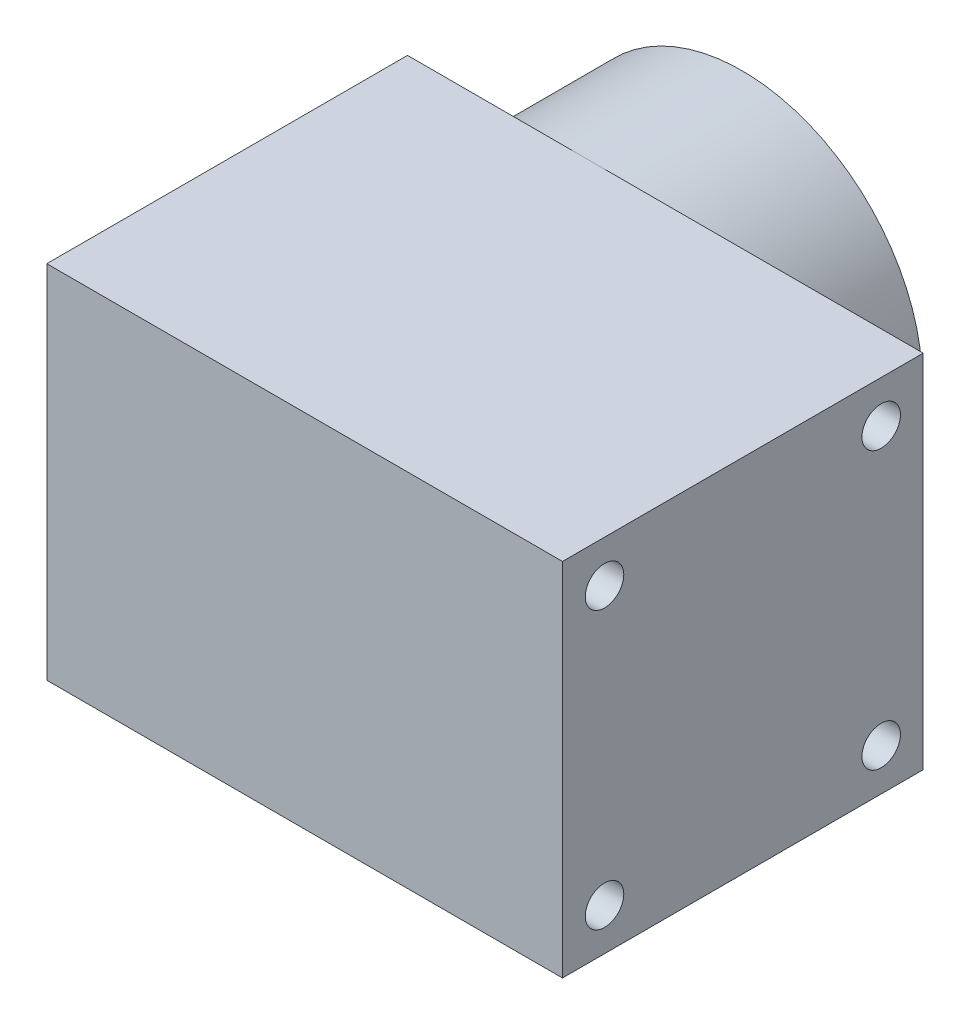
ISO-10303-21;
HEADER;
FILE_DESCRIPTION(('STEP AP214'),'2;1');
FILE_NAME('part.step','',(''),(''),'','','');
FILE_SCHEMA(('AUTOMOTIVE_DESIGN { 1 0 10303 214 1 1 1 1 }'));
ENDSEC;
DATA;
#1=APPLICATION_CONTEXT('core data for automotive mechanical design processes');
#2=APPLICATION_PROTOCOL_DEFINITION('international standard','automotive_design',2000,#1);
#3=PRODUCT_CONTEXT('',#1,'mechanical');
#4=PRODUCT('Part','Part','',(#3));
#5=PRODUCT_RELATED_PRODUCT_CATEGORY('part','',(#4));
#6=PRODUCT_DEFINITION_FORMATION('','',#4);
#7=PRODUCT_DEFINITION_CONTEXT('part definition',#1,'design');
#8=PRODUCT_DEFINITION('design','',#6,#7);
#9=PRODUCT_DEFINITION_SHAPE('','',#8);
#10=(LENGTH_UNIT() NAMED_UNIT(*) SI_UNIT(.MILLI.,.METRE.));
#11=(NAMED_UNIT(*) PLANE_ANGLE_UNIT() SI_UNIT($,.RADIAN.));
#12=(NAMED_UNIT(*) SI_UNIT($,.STERADIAN.) SOLID_ANGLE_UNIT());
#13=UNCERTAINTY_MEASURE_WITH_UNIT(LENGTH_MEASURE(1.E-05),#10,'distance_accuracy_value','');
#14=(GEOMETRIC_REPRESENTATION_CONTEXT(3) GLOBAL_UNCERTAINTY_ASSIGNED_CONTEXT((#13)) GLOBAL_UNIT_ASSIGNED_CONTEXT((#10,
#11,#12)) REPRESENTATION_CONTEXT('',''));
#15=CARTESIAN_POINT('',(0.,0.,0.));
#16=DIRECTION('',(0.,0.,1.));
#17=DIRECTION('',(1.,0.,0.));
#18=AXIS2_PLACEMENT_3D('',#15,#16,#17);
#19=CARTESIAN_POINT('',(0.,0.,24.));
#20=DIRECTION('',(0.,0.,-1.));
#21=DIRECTION('',(-1.,0.,0.));
#22=AXIS2_PLACEMENT_3D('',#19,#20,#21);
#23=CYLINDRICAL_SURFACE('',#22,28.1);
#24=CARTESIAN_POINT('',(0.,0.,24.));
#25=DIRECTION('',(0.,0.,1.));
#26=DIRECTION('',(1.,0.,0.));
#27=AXIS2_PLACEMENT_3D('',#24,#25,#26);
#28=CIRCLE('',#27,28.1);
#29=CARTESIAN_POINT('',(0.,-28.1,24.));
#30=VERTEX_POINT('',#29);
#31=CARTESIAN_POINT('',(0.,28.1,24.));
#32=VERTEX_POINT('',#31);
#33=EDGE_CURVE('E279',#30,#32,#28,.T.);
#34=ORIENTED_EDGE('',*,*,#33,.F.);
#35=CARTESIAN_POINT('',(-28.1,0.,24.));
#36=VERTEX_POINT('',#35);
#37=EDGE_CURVE('E284',#36,#30,#28,.T.);
#38=ORIENTED_EDGE('',*,*,#37,.F.);
#39=EDGE_CURVE('E283',#32,#36,#28,.T.);
#40=ORIENTED_EDGE('',*,*,#39,.F.);
#41=EDGE_LOOP('',(#34,#38,#40));
#42=FACE_BOUND('',#41,.T.);
#43=CARTESIAN_POINT('',(0.,0.,0.));
#44=DIRECTION('',(0.,0.,1.));
#45=DIRECTION('',(1.,0.,0.));
#46=AXIS2_PLACEMENT_3D('',#43,#44,#45);
#47=CIRCLE('',#46,28.1);
#48=CARTESIAN_POINT('',(28.1,0.,0.));
#49=VERTEX_POINT('',#48);
#50=EDGE_CURVE('E276',#49,#49,#47,.T.);
#51=ORIENTED_EDGE('',*,*,#50,.T.);
#52=EDGE_LOOP('',(#51));
#53=FACE_BOUND('',#52,.T.);
#54=ADVANCED_FACE('F36',(#42,#53),#23,.T.);
#55=CARTESIAN_POINT('',(0.,0.,0.));
#56=DIRECTION('',(0.,0.,1.));
#57=DIRECTION('',(1.,0.,0.));
#58=AXIS2_PLACEMENT_3D('',#55,#56,#57);
#59=PLANE('',#58);
#60=CARTESIAN_POINT('',(0.,0.,0.));
#61=DIRECTION('',(0.,0.,-1.));
#62=DIRECTION('',(0.,1.,0.));
#63=AXIS2_PLACEMENT_3D('',#60,#61,#62);
#64=CIRCLE('',#63,15.);
#65=CARTESIAN_POINT('',(0.,15.,0.));
#66=VERTEX_POINT('',#65);
#67=CARTESIAN_POINT('',(15.,0.,0.));
#68=VERTEX_POINT('',#67);
#69=EDGE_CURVE('E167',#66,#68,#64,.T.);
#70=ORIENTED_EDGE('',*,*,#69,.T.);
#71=DIRECTION('',(-1.,0.,0.));
#72=VECTOR('',#71,1.);
#73=CARTESIAN_POINT('',(15.,0.,0.));
#74=LINE('',#73,#72);
#75=CARTESIAN_POINT('',(22.5,0.,0.));
#76=VERTEX_POINT('',#75);
#77=EDGE_CURVE('E183',#76,#68,#74,.T.);
#78=ORIENTED_EDGE('',*,*,#77,.F.);
#79=CARTESIAN_POINT('',(0.,0.,0.));
#80=DIRECTION('',(0.,0.,-1.));
#81=DIRECTION('',(0.,1.,0.));
#82=AXIS2_PLACEMENT_3D('',#79,#80,#81);
#83=CIRCLE('',#82,22.5);
#84=CARTESIAN_POINT('',(0.,22.5,0.));
#85=VERTEX_POINT('',#84);
#86=EDGE_CURVE('E177',#85,#76,#83,.T.);
#87=ORIENTED_EDGE('',*,*,#86,.F.);
#88=DIRECTION('',(0.,-1.,0.));
#89=VECTOR('',#88,1.);
#90=CARTESIAN_POINT('',(0.,15.,0.));
#91=LINE('',#90,#89);
#92=EDGE_CURVE('E52',#85,#66,#91,.T.);
#93=ORIENTED_EDGE('',*,*,#92,.T.);
#94=EDGE_LOOP('',(#70,#78,#87,#93));
#95=FACE_BOUND('',#94,.T.);
#96=CARTESIAN_POINT('',(0.,0.,0.));
#97=DIRECTION('',(0.,0.,-1.));
#98=DIRECTION('',(-1.,0.,0.));
#99=AXIS2_PLACEMENT_3D('',#96,#97,#98);
#100=CIRCLE('',#99,6.025);
#101=CARTESIAN_POINT('',(-6.025,0.,0.));
#102=VERTEX_POINT('',#101);
#103=EDGE_CURVE('E253',#102,#102,#100,.T.);
#104=ORIENTED_EDGE('',*,*,#103,.F.);
#105=EDGE_LOOP('',(#104));
#106=FACE_BOUND('',#105,.T.);
#107=ORIENTED_EDGE('',*,*,#50,.F.);
#108=EDGE_LOOP('',(#107));
#109=FACE_BOUND('',#108,.T.);
#110=ADVANCED_FACE('F175',(#95,#106,#109),#59,.F.);
#111=CARTESIAN_POINT('',(0.,0.,6.2));
#112=DIRECTION('',(0.,0.,-1.));
#113=DIRECTION('',(-1.,0.,0.));
#114=AXIS2_PLACEMENT_3D('',#111,#112,#113);
#115=PLANE('',#114);
#116=CARTESIAN_POINT('',(0.,0.,6.2));
#117=DIRECTION('',(0.,0.,-1.));
#118=DIRECTION('',(-1.,0.,0.));
#119=AXIS2_PLACEMENT_3D('',#116,#117,#118);
#120=CIRCLE('',#119,6.025);
#121=CARTESIAN_POINT('',(-6.025,0.,6.2));
#122=VERTEX_POINT('',#121);
#123=EDGE_CURVE('E254',#122,#122,#120,.T.);
#124=ORIENTED_EDGE('',*,*,#123,.T.);
#125=EDGE_LOOP('',(#124));
#126=FACE_BOUND('',#125,.T.);
#127=CARTESIAN_POINT('',(0.,0.,6.2));
#128=DIRECTION('',(0.,0.,-1.));
#129=DIRECTION('',(-1.,0.,0.));
#130=AXIS2_PLACEMENT_3D('',#127,#128,#129);
#131=CIRCLE('',#130,3.00193031696681);
#132=CARTESIAN_POINT('',(-1.66180192198844,2.5,6.2));
#133=VERTEX_POINT('',#132);
#134=CARTESIAN_POINT('',(1.66180192198844,2.5,6.2));
#135=VERTEX_POINT('',#134);
#136=EDGE_CURVE('E262',#133,#135,#131,.F.);
#137=ORIENTED_EDGE('',*,*,#136,.T.);
#138=DIRECTION('',(-1.,0.,0.));
#139=VECTOR('',#138,1.);
#140=CARTESIAN_POINT('',(1.66180192198844,2.5,6.2));
#141=LINE('',#140,#139);
#142=CARTESIAN_POINT('',(1.6583123951777,2.5,6.2));
#143=VERTEX_POINT('',#142);
#144=EDGE_CURVE('E261',#135,#143,#141,.T.);
#145=ORIENTED_EDGE('',*,*,#144,.T.);
#146=CARTESIAN_POINT('',(0.,0.,6.2));
#147=DIRECTION('',(0.,0.,-1.));
#148=DIRECTION('',(-1.,0.,0.));
#149=AXIS2_PLACEMENT_3D('',#146,#147,#148);
#150=CIRCLE('',#149,3.);
#151=CARTESIAN_POINT('',(-1.6583123951777,2.5,6.2));
#152=VERTEX_POINT('',#151);
#153=EDGE_CURVE('E294',#143,#152,#150,.F.);
#154=ORIENTED_EDGE('',*,*,#153,.T.);
#155=EDGE_CURVE('E257',#152,#133,#141,.T.);
#156=ORIENTED_EDGE('',*,*,#155,.T.);
#157=EDGE_LOOP('',(#137,#145,#154,#156));
#158=FACE_BOUND('',#157,.T.);
#159=ADVANCED_FACE('F393',(#126,#158),#115,.T.);
#160=CARTESIAN_POINT('',(0.,0.,6.2));
#161=DIRECTION('',(0.,0.,-1.));
#162=DIRECTION('',(-1.,0.,0.));
#163=AXIS2_PLACEMENT_3D('',#160,#161,#162);
#164=CYLINDRICAL_SURFACE('',#163,6.025);
#165=CARTESIAN_POINT('',(-6.025,0.,6.2));
#166=CARTESIAN_POINT('',(-6.025,0.,6.13541666666667));
#167=CARTESIAN_POINT('',(-6.025,0.,6.07083333333333));
#168=CARTESIAN_POINT('',(-6.025,0.,5.94166666666667));
#169=CARTESIAN_POINT('',(-6.025,0.,5.87708333333333));
#170=CARTESIAN_POINT('',(-6.025,0.,5.74791666666667));
#171=CARTESIAN_POINT('',(-6.025,0.,5.68333333333333));
#172=CARTESIAN_POINT('',(-6.025,0.,5.55416666666667));
#173=CARTESIAN_POINT('',(-6.025,0.,5.48958333333333));
#174=CARTESIAN_POINT('',(-6.025,0.,5.36041666666667));
#175=CARTESIAN_POINT('',(-6.025,0.,5.29583333333333));
#176=CARTESIAN_POINT('',(-6.025,0.,5.16666666666667));
#177=CARTESIAN_POINT('',(-6.025,0.,5.10208333333333));
#178=CARTESIAN_POINT('',(-6.025,0.,4.97291666666667));
#179=CARTESIAN_POINT('',(-6.025,0.,4.90833333333333));
#180=CARTESIAN_POINT('',(-6.025,0.,4.77916666666667));
#181=CARTESIAN_POINT('',(-6.025,0.,4.71458333333333));
#182=CARTESIAN_POINT('',(-6.025,0.,4.58541666666667));
#183=CARTESIAN_POINT('',(-6.025,0.,4.52083333333333));
#184=CARTESIAN_POINT('',(-6.025,0.,4.39166666666667));
#185=CARTESIAN_POINT('',(-6.025,0.,4.32708333333333));
#186=CARTESIAN_POINT('',(-6.025,0.,4.19791666666667));
#187=CARTESIAN_POINT('',(-6.025,0.,4.13333333333333));
#188=CARTESIAN_POINT('',(-6.025,0.,4.00416666666667));
#189=CARTESIAN_POINT('',(-6.025,0.,3.93958333333333));
#190=CARTESIAN_POINT('',(-6.025,0.,3.81041666666667));
#191=CARTESIAN_POINT('',(-6.025,0.,3.74583333333333));
#192=CARTESIAN_POINT('',(-6.025,0.,3.61666666666667));
#193=CARTESIAN_POINT('',(-6.025,0.,3.55208333333333));
#194=CARTESIAN_POINT('',(-6.025,0.,3.42291666666667));
#195=CARTESIAN_POINT('',(-6.025,0.,3.35833333333333));
#196=CARTESIAN_POINT('',(-6.025,0.,3.22916666666667));
#197=CARTESIAN_POINT('',(-6.025,0.,3.16458333333333));
#198=CARTESIAN_POINT('',(-6.025,0.,3.03541666666667));
#199=CARTESIAN_POINT('',(-6.025,0.,2.97083333333333));
#200=CARTESIAN_POINT('',(-6.025,0.,2.84166666666667));
#201=CARTESIAN_POINT('',(-6.025,0.,2.77708333333333));
#202=CARTESIAN_POINT('',(-6.025,0.,2.64791666666667));
#203=CARTESIAN_POINT('',(-6.025,0.,2.58333333333333));
#204=CARTESIAN_POINT('',(-6.025,0.,2.45416666666667));
#205=CARTESIAN_POINT('',(-6.025,0.,2.38958333333333));
#206=CARTESIAN_POINT('',(-6.025,0.,2.26041666666667));
#207=CARTESIAN_POINT('',(-6.025,0.,2.19583333333333));
#208=CARTESIAN_POINT('',(-6.025,0.,2.06666666666667));
#209=CARTESIAN_POINT('',(-6.025,0.,2.00208333333333));
#210=CARTESIAN_POINT('',(-6.025,0.,1.87291666666667));
#211=CARTESIAN_POINT('',(-6.025,0.,1.80833333333333));
#212=CARTESIAN_POINT('',(-6.025,0.,1.67916666666667));
#213=CARTESIAN_POINT('',(-6.025,0.,1.61458333333333));
#214=CARTESIAN_POINT('',(-6.025,0.,1.48541666666667));
#215=CARTESIAN_POINT('',(-6.025,0.,1.42083333333333));
#216=CARTESIAN_POINT('',(-6.025,0.,1.29166666666667));
#217=CARTESIAN_POINT('',(-6.025,0.,1.22708333333333));
#218=CARTESIAN_POINT('',(-6.025,0.,1.09791666666667));
#219=CARTESIAN_POINT('',(-6.025,0.,1.03333333333333));
#220=CARTESIAN_POINT('',(-6.025,0.,0.904166666666667));
#221=CARTESIAN_POINT('',(-6.025,0.,0.839583333333333));
#222=CARTESIAN_POINT('',(-6.025,0.,0.710416666666666));
#223=CARTESIAN_POINT('',(-6.025,0.,0.645833333333333));
#224=CARTESIAN_POINT('',(-6.025,0.,0.516666666666667));
#225=CARTESIAN_POINT('',(-6.025,0.,0.452083333333333));
#226=CARTESIAN_POINT('',(-6.025,0.,0.322916666666667));
#227=CARTESIAN_POINT('',(-6.025,0.,0.258333333333334));
#228=CARTESIAN_POINT('',(-6.025,0.,0.129166666666667));
#229=CARTESIAN_POINT('',(-6.025,0.,0.0645833333333335));
#230=CARTESIAN_POINT('',(-6.025,0.,0.));
#231=B_SPLINE_CURVE_WITH_KNOTS('',3,(#165,#166,#167,#168,#169,#170,#171,#172,#173,#174,#175,
#176,#177,#178,#179,#180,#181,#182,#183,#184,#185,#186,#187,#188,#189,#190,#191,#192,#193,#194,
#195,#196,#197,#198,#199,#200,#201,#202,#203,#204,#205,#206,#207,#208,#209,#210,#211,#212,#213,
#214,#215,#216,#217,#218,#219,#220,#221,#222,#223,#224,#225,#226,#227,#228,#229,#230),
.UNSPECIFIED.,.F.,.F.,(4,2,2,2,2,2,2,2,2,2,2,2,2,2,2,2,2,2,2,2,2,2,2,2,2,2,2,2,2,2,2,2,4),(0.,
0.193749999999999,0.3875,0.581249999999999,0.775,0.96875,1.1625,1.35625,1.55,1.74375,1.9375,
2.13125,2.325,2.51875,2.7125,2.90625,3.1,3.29375,3.4875,3.68125,3.875,4.06875,4.2625,4.45625,
4.65,4.84375,5.0375,5.23125,5.425,5.61875,5.8125,6.00625,6.2),.UNSPECIFIED.);
#232=EDGE_CURVE('BSEAM400',#122,#102,#231,.T.);
#233=ORIENTED_EDGE('',*,*,#123,.F.);
#234=ORIENTED_EDGE('',*,*,#103,.T.);
#235=ORIENTED_EDGE('',*,*,#232,.T.);
#236=ORIENTED_EDGE('',*,*,#232,.F.);
#237=EDGE_LOOP('',(#233,#235,#234,#236));
#238=FACE_BOUND('',#237,.T.);
#239=ADVANCED_FACE('F400',(#238),#164,.F.);
#240=CARTESIAN_POINT('',(0.,0.,21.5));
#241=DIRECTION('',(0.,0.,-1.));
#242=DIRECTION('',(-1.,0.,0.));
#243=AXIS2_PLACEMENT_3D('',#240,#241,#242);
#244=PLANE('',#243);
#245=CARTESIAN_POINT('',(0.,0.,21.5));
#246=DIRECTION('',(0.,0.,-1.));
#247=DIRECTION('',(-1.,0.,0.));
#248=AXIS2_PLACEMENT_3D('',#245,#246,#247);
#249=CIRCLE('',#248,3.00193031696681);
#250=CARTESIAN_POINT('',(1.66180192198844,2.5,21.5));
#251=VERTEX_POINT('',#250);
#252=CARTESIAN_POINT('',(-1.66180192198844,2.5,21.5));
#253=VERTEX_POINT('',#252);
#254=EDGE_CURVE('E266',#251,#253,#249,.T.);
#255=ORIENTED_EDGE('',*,*,#254,.T.);
#256=DIRECTION('',(1.,0.,0.));
#257=VECTOR('',#256,1.);
#258=CARTESIAN_POINT('',(1.66180192198844,2.5,21.5));
#259=LINE('',#258,#257);
#260=EDGE_CURVE('E269',#253,#251,#259,.T.);
#261=ORIENTED_EDGE('',*,*,#260,.T.);
#262=EDGE_LOOP('',(#255,#261));
#263=FACE_BOUND('',#262,.T.);
#264=ADVANCED_FACE('F413',(#263),#244,.T.);
#265=CARTESIAN_POINT('',(0.,0.,9.5));
#266=DIRECTION('',(0.,0.,-1.));
#267=DIRECTION('',(-1.,0.,0.));
#268=AXIS2_PLACEMENT_3D('',#265,#266,#267);
#269=PLANE('',#268);
#270=DIRECTION('',(-1.,0.,0.));
#271=VECTOR('',#270,1.);
#272=CARTESIAN_POINT('',(1.66180192198844,2.5,9.5));
#273=LINE('',#272,#271);
#274=CARTESIAN_POINT('',(1.6583123951777,2.5,9.5));
#275=VERTEX_POINT('',#274);
#276=CARTESIAN_POINT('',(-1.6583123951777,2.5,9.5));
#277=VERTEX_POINT('',#276);
#278=EDGE_CURVE('E282',#275,#277,#273,.T.);
#279=ORIENTED_EDGE('',*,*,#278,.T.);
#280=CARTESIAN_POINT('',(0.,0.,9.5));
#281=DIRECTION('',(0.,0.,-1.));
#282=DIRECTION('',(-1.,0.,0.));
#283=AXIS2_PLACEMENT_3D('',#280,#281,#282);
#284=CIRCLE('',#283,3.);
#285=EDGE_CURVE('E264',#277,#275,#284,.T.);
#286=ORIENTED_EDGE('',*,*,#285,.T.);
#287=EDGE_LOOP('',(#279,#286));
#288=FACE_BOUND('',#287,.T.);
#289=ADVANCED_FACE('F416',(#288),#269,.T.);
#290=CARTESIAN_POINT('',(0.,0.,9.5));
#291=DIRECTION('',(0.,0.,-1.));
#292=DIRECTION('',(-1.,0.,0.));
#293=AXIS2_PLACEMENT_3D('',#290,#291,#292);
#294=CYLINDRICAL_SURFACE('',#293,3.);
#295=ORIENTED_EDGE('',*,*,#153,.F.);
#296=DIRECTION('',(0.,0.,-1.));
#297=VECTOR('',#296,1.);
#298=CARTESIAN_POINT('',(1.6583123951777,2.5,9.5));
#299=LINE('',#298,#297);
#300=EDGE_CURVE('E291',#275,#143,#299,.T.);
#301=ORIENTED_EDGE('',*,*,#300,.F.);
#302=ORIENTED_EDGE('',*,*,#285,.F.);
#303=DIRECTION('',(0.,0.,-1.));
#304=VECTOR('',#303,1.);
#305=CARTESIAN_POINT('',(-1.6583123951777,2.5,9.5));
#306=LINE('',#305,#304);
#307=EDGE_CURVE('E289',#152,#277,#306,.F.);
#308=ORIENTED_EDGE('',*,*,#307,.F.);
#309=EDGE_LOOP('',(#295,#301,#302,#308));
#310=FACE_BOUND('',#309,.T.);
#311=ADVANCED_FACE('F411',(#310),#294,.F.);
#312=CARTESIAN_POINT('',(1.66180192198844,2.5,21.5));
#313=DIRECTION('',(0.,1.,0.));
#314=DIRECTION('',(0.,0.,1.));
#315=AXIS2_PLACEMENT_3D('',#312,#313,#314);
#316=PLANE('',#315);
#317=ORIENTED_EDGE('',*,*,#144,.F.);
#318=DIRECTION('',(0.,0.,-1.));
#319=VECTOR('',#318,1.);
#320=CARTESIAN_POINT('',(1.66180192198844,2.5,21.5));
#321=LINE('',#320,#319);
#322=EDGE_CURVE('E273',#251,#135,#321,.T.);
#323=ORIENTED_EDGE('',*,*,#322,.F.);
#324=ORIENTED_EDGE('',*,*,#260,.F.);
#325=DIRECTION('',(0.,0.,-1.));
#326=VECTOR('',#325,1.);
#327=CARTESIAN_POINT('',(-1.66180192198844,2.5,21.5));
#328=LINE('',#327,#326);
#329=EDGE_CURVE('E272',#253,#133,#328,.T.);
#330=ORIENTED_EDGE('',*,*,#329,.T.);
#331=ORIENTED_EDGE('',*,*,#155,.F.);
#332=ORIENTED_EDGE('',*,*,#307,.T.);
#333=ORIENTED_EDGE('',*,*,#278,.F.);
#334=ORIENTED_EDGE('',*,*,#300,.T.);
#335=EDGE_LOOP('',(#317,#323,#324,#330,#331,#332,#333,#334));
#336=FACE_BOUND('',#335,.T.);
#337=ADVANCED_FACE('F407',(#336),#316,.F.);
#338=CARTESIAN_POINT('',(0.,0.,21.5));
#339=DIRECTION('',(0.,0.,-1.));
#340=DIRECTION('',(-1.,0.,0.));
#341=AXIS2_PLACEMENT_3D('',#338,#339,#340);
#342=CYLINDRICAL_SURFACE('',#341,3.00193031696681);
#343=ORIENTED_EDGE('',*,*,#136,.F.);
#344=ORIENTED_EDGE('',*,*,#329,.F.);
#345=ORIENTED_EDGE('',*,*,#254,.F.);
#346=ORIENTED_EDGE('',*,*,#322,.T.);
#347=EDGE_LOOP('',(#343,#344,#345,#346));
#348=FACE_BOUND('',#347,.T.);
#349=ADVANCED_FACE('F404',(#348),#342,.F.);
#350=CARTESIAN_POINT('',(0.,0.,24.));
#351=DIRECTION('',(0.,0.,-1.));
#352=DIRECTION('',(-1.,0.,0.));
#353=AXIS2_PLACEMENT_3D('',#350,#351,#352);
#354=PLANE('',#353);
#355=DIRECTION('',(-1.,0.,0.));
#356=VECTOR('',#355,1.);
#357=CARTESIAN_POINT('',(-28.1,28.1,24.));
#358=LINE('',#357,#356);
#359=CARTESIAN_POINT('',(52.24,28.1,24.));
#360=VERTEX_POINT('',#359);
#361=EDGE_CURVE('E238',#360,#32,#358,.T.);
#362=ORIENTED_EDGE('',*,*,#361,.F.);
#363=DIRECTION('',(0.,1.,0.));
#364=VECTOR('',#363,1.);
#365=CARTESIAN_POINT('',(52.24,28.1,24.));
#366=LINE('',#365,#364);
#367=CARTESIAN_POINT('',(52.24,-28.1,24.));
#368=VERTEX_POINT('',#367);
#369=EDGE_CURVE('E223',#368,#360,#366,.T.);
#370=ORIENTED_EDGE('',*,*,#369,.F.);
#371=DIRECTION('',(1.,0.,0.));
#372=VECTOR('',#371,1.);
#373=CARTESIAN_POINT('',(-28.1,-28.1,24.));
#374=LINE('',#373,#372);
#375=EDGE_CURVE('E245',#30,#368,#374,.T.);
#376=ORIENTED_EDGE('',*,*,#375,.F.);
#377=ORIENTED_EDGE('',*,*,#33,.T.);
#378=EDGE_LOOP('',(#362,#370,#376,#377));
#379=FACE_BOUND('',#378,.T.);
#380=ADVANCED_FACE('F374',(#379),#354,.T.);
#381=CARTESIAN_POINT('',(-28.1,28.1,24.));
#382=VERTEX_POINT('',#381);
#383=EDGE_CURVE('E229',#32,#382,#358,.T.);
#384=ORIENTED_EDGE('',*,*,#383,.F.);
#385=ORIENTED_EDGE('',*,*,#39,.T.);
#386=DIRECTION('',(0.,-1.,0.));
#387=VECTOR('',#386,1.);
#388=CARTESIAN_POINT('',(-28.1,-28.1,24.));
#389=LINE('',#388,#387);
#390=EDGE_CURVE('E242',#382,#36,#389,.T.);
#391=ORIENTED_EDGE('',*,*,#390,.F.);
#392=EDGE_LOOP('',(#384,#385,#391));
#393=FACE_BOUND('',#392,.T.);
#394=ADVANCED_FACE('F357',(#393),#354,.T.);
#395=CARTESIAN_POINT('',(-28.1,-28.1,24.));
#396=VERTEX_POINT('',#395);
#397=EDGE_CURVE('E241',#36,#396,#389,.T.);
#398=ORIENTED_EDGE('',*,*,#397,.F.);
#399=ORIENTED_EDGE('',*,*,#37,.T.);
#400=EDGE_CURVE('E233',#396,#30,#374,.T.);
#401=ORIENTED_EDGE('',*,*,#400,.F.);
#402=EDGE_LOOP('',(#398,#399,#401));
#403=FACE_BOUND('',#402,.T.);
#404=ADVANCED_FACE('F362',(#403),#354,.T.);
#405=CARTESIAN_POINT('',(-28.1,28.1,80.2));
#406=DIRECTION('',(0.,-1.,0.));
#407=DIRECTION('',(0.,0.,-1.));
#408=AXIS2_PLACEMENT_3D('',#405,#406,#407);
#409=PLANE('',#408);
#410=ORIENTED_EDGE('',*,*,#361,.T.);
#411=ORIENTED_EDGE('',*,*,#383,.T.);
#412=DIRECTION('',(0.,0.,-1.));
#413=VECTOR('',#412,1.);
#414=CARTESIAN_POINT('',(-28.1,28.1,80.2));
#415=LINE('',#414,#413);
#416=CARTESIAN_POINT('',(-28.1,28.1,80.2));
#417=VERTEX_POINT('',#416);
#418=EDGE_CURVE('E250',#417,#382,#415,.T.);
#419=ORIENTED_EDGE('',*,*,#418,.F.);
#420=DIRECTION('',(-1.,0.,0.));
#421=VECTOR('',#420,1.);
#422=CARTESIAN_POINT('',(-28.1,28.1,80.2));
#423=LINE('',#422,#421);
#424=CARTESIAN_POINT('',(52.24,28.1,80.2));
#425=VERTEX_POINT('',#424);
#426=EDGE_CURVE('E230',#425,#417,#423,.T.);
#427=ORIENTED_EDGE('',*,*,#426,.F.);
#428=DIRECTION('',(0.,0.,1.));
#429=VECTOR('',#428,1.);
#430=CARTESIAN_POINT('',(52.24,28.1,80.2));
#431=LINE('',#430,#429);
#432=EDGE_CURVE('E226',#360,#425,#431,.T.);
#433=ORIENTED_EDGE('',*,*,#432,.F.);
#434=EDGE_LOOP('',(#410,#411,#419,#427,#433));
#435=FACE_BOUND('',#434,.T.);
#436=ADVANCED_FACE('F347',(#435),#409,.F.);
#437=CARTESIAN_POINT('',(-28.1,-28.1,80.2));
#438=DIRECTION('',(1.,0.,0.));
#439=DIRECTION('',(0.,0.,-1.));
#440=AXIS2_PLACEMENT_3D('',#437,#438,#439);
#441=PLANE('',#440);
#442=DIRECTION('',(0.,0.,1.));
#443=VECTOR('',#442,1.);
#444=CARTESIAN_POINT('',(-28.1,-25.6,26.5));
#445=LINE('',#444,#443);
#446=CARTESIAN_POINT('',(-28.1,-25.6,26.5));
#447=VERTEX_POINT('',#446);
#448=CARTESIAN_POINT('',(-28.1,-25.6,77.7));
#449=VERTEX_POINT('',#448);
#450=EDGE_CURVE('E201',#447,#449,#445,.T.);
#451=ORIENTED_EDGE('',*,*,#450,.F.);
#452=DIRECTION('',(0.,-1.,0.));
#453=VECTOR('',#452,1.);
#454=CARTESIAN_POINT('',(-28.1,25.6,26.5));
#455=LINE('',#454,#453);
#456=CARTESIAN_POINT('',(-28.1,25.6,26.5));
#457=VERTEX_POINT('',#456);
#458=EDGE_CURVE('E185',#457,#447,#455,.T.);
#459=ORIENTED_EDGE('',*,*,#458,.F.);
#460=DIRECTION('',(0.,0.,-1.));
#461=VECTOR('',#460,1.);
#462=CARTESIAN_POINT('',(-28.1,25.6,26.5));
#463=LINE('',#462,#461);
#464=CARTESIAN_POINT('',(-28.1,25.6,77.7));
#465=VERTEX_POINT('',#464);
#466=EDGE_CURVE('E190',#465,#457,#463,.T.);
#467=ORIENTED_EDGE('',*,*,#466,.F.);
#468=DIRECTION('',(0.,1.,0.));
#469=VECTOR('',#468,1.);
#470=CARTESIAN_POINT('',(-28.1,25.6,77.7));
#471=LINE('',#470,#469);
#472=EDGE_CURVE('E204',#449,#465,#471,.T.);
#473=ORIENTED_EDGE('',*,*,#472,.F.);
#474=EDGE_LOOP('',(#451,#459,#467,#473));
#475=FACE_BOUND('',#474,.T.);
#476=ORIENTED_EDGE('',*,*,#390,.T.);
#477=ORIENTED_EDGE('',*,*,#397,.T.);
#478=DIRECTION('',(0.,0.,-1.));
#479=VECTOR('',#478,1.);
#480=CARTESIAN_POINT('',(-28.1,-28.1,80.2));
#481=LINE('',#480,#479);
#482=CARTESIAN_POINT('',(-28.1,-28.1,80.2));
#483=VERTEX_POINT('',#482);
#484=EDGE_CURVE('E237',#483,#396,#481,.T.);
#485=ORIENTED_EDGE('',*,*,#484,.F.);
#486=DIRECTION('',(0.,-1.,0.));
#487=VECTOR('',#486,1.);
#488=CARTESIAN_POINT('',(-28.1,-28.1,80.2));
#489=LINE('',#488,#487);
#490=EDGE_CURVE('E232',#417,#483,#489,.T.);
#491=ORIENTED_EDGE('',*,*,#490,.F.);
#492=ORIENTED_EDGE('',*,*,#418,.T.);
#493=EDGE_LOOP('',(#476,#477,#485,#491,#492));
#494=FACE_BOUND('',#493,.T.);
#495=ADVANCED_FACE('F343',(#475,#494),#441,.F.);
#496=CARTESIAN_POINT('',(-28.1,-28.1,80.2));
#497=DIRECTION('',(0.,1.,0.));
#498=DIRECTION('',(0.,0.,1.));
#499=AXIS2_PLACEMENT_3D('',#496,#497,#498);
#500=PLANE('',#499);
#501=ORIENTED_EDGE('',*,*,#400,.T.);
#502=ORIENTED_EDGE('',*,*,#375,.T.);
#503=DIRECTION('',(0.,0.,-1.));
#504=VECTOR('',#503,1.);
#505=CARTESIAN_POINT('',(52.24,-28.1,80.2));
#506=LINE('',#505,#504);
#507=CARTESIAN_POINT('',(52.24,-28.1,80.2));
#508=VERTEX_POINT('',#507);
#509=EDGE_CURVE('E220',#508,#368,#506,.T.);
#510=ORIENTED_EDGE('',*,*,#509,.F.);
#511=DIRECTION('',(1.,0.,0.));
#512=VECTOR('',#511,1.);
#513=CARTESIAN_POINT('',(-28.1,-28.1,80.2));
#514=LINE('',#513,#512);
#515=EDGE_CURVE('E235',#483,#508,#514,.T.);
#516=ORIENTED_EDGE('',*,*,#515,.F.);
#517=ORIENTED_EDGE('',*,*,#484,.T.);
#518=EDGE_LOOP('',(#501,#502,#510,#516,#517));
#519=FACE_BOUND('',#518,.T.);
#520=ADVANCED_FACE('F346',(#519),#500,.F.);
#521=CARTESIAN_POINT('',(0.,0.,80.2));
#522=DIRECTION('',(0.,0.,-1.));
#523=DIRECTION('',(-1.,0.,0.));
#524=AXIS2_PLACEMENT_3D('',#521,#522,#523);
#525=PLANE('',#524);
#526=ORIENTED_EDGE('',*,*,#515,.T.);
#527=DIRECTION('',(0.,-1.,0.));
#528=VECTOR('',#527,1.);
#529=CARTESIAN_POINT('',(52.24,28.1,80.2));
#530=LINE('',#529,#528);
#531=EDGE_CURVE('E211',#425,#508,#530,.T.);
#532=ORIENTED_EDGE('',*,*,#531,.F.);
#533=ORIENTED_EDGE('',*,*,#426,.T.);
#534=ORIENTED_EDGE('',*,*,#490,.T.);
#535=EDGE_LOOP('',(#526,#532,#533,#534));
#536=FACE_BOUND('',#535,.T.);
#537=ADVANCED_FACE('F368',(#536),#525,.F.);
#538=CARTESIAN_POINT('',(52.24,0.,0.));
#539=DIRECTION('',(1.,0.,0.));
#540=DIRECTION('',(0.,0.,-1.));
#541=AXIS2_PLACEMENT_3D('',#538,#539,#540);
#542=PLANE('',#541);
#543=CARTESIAN_POINT('',(52.24,-21.55,73.65));
#544=DIRECTION('',(1.,0.,0.));
#545=DIRECTION('',(0.,0.,-1.));
#546=AXIS2_PLACEMENT_3D('',#543,#544,#545);
#547=CIRCLE('',#546,3.00000000000001);
#548=CARTESIAN_POINT('',(52.24,-21.55,70.65));
#549=VERTEX_POINT('',#548);
#550=EDGE_CURVE('E585',#549,#549,#547,.T.);
#551=ORIENTED_EDGE('',*,*,#550,.F.);
#552=EDGE_LOOP('',(#551));
#553=FACE_BOUND('',#552,.T.);
#554=CARTESIAN_POINT('',(52.24,-21.55,30.55));
#555=DIRECTION('',(1.,0.,0.));
#556=DIRECTION('',(0.,0.,-1.));
#557=AXIS2_PLACEMENT_3D('',#554,#555,#556);
#558=CIRCLE('',#557,3.);
#559=CARTESIAN_POINT('',(52.24,-21.55,27.55));
#560=VERTEX_POINT('',#559);
#561=EDGE_CURVE('E583',#560,#560,#558,.T.);
#562=ORIENTED_EDGE('',*,*,#561,.F.);
#563=EDGE_LOOP('',(#562));
#564=FACE_BOUND('',#563,.T.);
#565=CARTESIAN_POINT('',(52.24,21.55,30.55));
#566=DIRECTION('',(1.,0.,0.));
#567=DIRECTION('',(0.,0.,-1.));
#568=AXIS2_PLACEMENT_3D('',#565,#566,#567);
#569=CIRCLE('',#568,3.);
#570=CARTESIAN_POINT('',(52.24,21.55,27.55));
#571=VERTEX_POINT('',#570);
#572=EDGE_CURVE('E584',#571,#571,#569,.T.);
#573=ORIENTED_EDGE('',*,*,#572,.F.);
#574=EDGE_LOOP('',(#573));
#575=FACE_BOUND('',#574,.T.);
#576=CARTESIAN_POINT('',(52.24,21.55,73.65));
#577=DIRECTION('',(1.,0.,0.));
#578=DIRECTION('',(0.,0.,-1.));
#579=AXIS2_PLACEMENT_3D('',#576,#577,#578);
#580=CIRCLE('',#579,3.00000000000001);
#581=CARTESIAN_POINT('',(52.24,21.55,70.65));
#582=VERTEX_POINT('',#581);
#583=EDGE_CURVE('E305',#582,#582,#580,.T.);
#584=ORIENTED_EDGE('',*,*,#583,.F.);
#585=EDGE_LOOP('',(#584));
#586=FACE_BOUND('',#585,.T.);
#587=ORIENTED_EDGE('',*,*,#531,.T.);
#588=ORIENTED_EDGE('',*,*,#509,.T.);
#589=ORIENTED_EDGE('',*,*,#369,.T.);
#590=ORIENTED_EDGE('',*,*,#432,.T.);
#591=EDGE_LOOP('',(#587,#588,#589,#590));
#592=FACE_BOUND('',#591,.T.);
#593=ADVANCED_FACE('F376',(#553,#564,#575,#586,#592),#542,.T.);
#594=CARTESIAN_POINT('',(35.6,25.6,26.5));
#595=DIRECTION('',(0.,0.,-1.));
#596=DIRECTION('',(-1.,0.,0.));
#597=AXIS2_PLACEMENT_3D('',#594,#595,#596);
#598=PLANE('',#597);
#599=CARTESIAN_POINT('',(0.,0.,26.5));
#600=DIRECTION('',(0.,0.,-1.));
#601=DIRECTION('',(-1.,0.,0.));
#602=AXIS2_PLACEMENT_3D('',#599,#600,#601);
#603=CIRCLE('',#602,15.);
#604=CARTESIAN_POINT('',(0.,15.,26.5));
#605=VERTEX_POINT('',#604);
#606=CARTESIAN_POINT('',(15.,0.,26.5));
#607=VERTEX_POINT('',#606);
#608=EDGE_CURVE('E11',#605,#607,#603,.T.);
#609=ORIENTED_EDGE('',*,*,#608,.F.);
#610=DIRECTION('',(0.,1.,0.));
#611=VECTOR('',#610,1.);
#612=CARTESIAN_POINT('',(0.,25.6,26.5));
#613=LINE('',#612,#611);
#614=CARTESIAN_POINT('',(0.,22.5,26.5));
#615=VERTEX_POINT('',#614);
#616=EDGE_CURVE('E44',#605,#615,#613,.T.);
#617=ORIENTED_EDGE('',*,*,#616,.T.);
#618=CARTESIAN_POINT('',(0.,0.,26.5));
#619=DIRECTION('',(0.,0.,-1.));
#620=DIRECTION('',(-1.,0.,0.));
#621=AXIS2_PLACEMENT_3D('',#618,#619,#620);
#622=CIRCLE('',#621,22.5);
#623=CARTESIAN_POINT('',(22.5,0.,26.5));
#624=VERTEX_POINT('',#623);
#625=EDGE_CURVE('E296',#624,#615,#622,.F.);
#626=ORIENTED_EDGE('',*,*,#625,.F.);
#627=DIRECTION('',(1.,0.,0.));
#628=VECTOR('',#627,1.);
#629=CARTESIAN_POINT('',(35.6,0.,26.5));
#630=LINE('',#629,#628);
#631=EDGE_CURVE('E298',#607,#624,#630,.T.);
#632=ORIENTED_EDGE('',*,*,#631,.F.);
#633=EDGE_LOOP('',(#609,#617,#626,#632));
#634=FACE_BOUND('',#633,.T.);
#635=ORIENTED_EDGE('',*,*,#458,.T.);
#636=DIRECTION('',(-1.,0.,0.));
#637=VECTOR('',#636,1.);
#638=CARTESIAN_POINT('',(35.6,-25.6,26.5));
#639=LINE('',#638,#637);
#640=CARTESIAN_POINT('',(35.6,-25.6,26.5));
#641=VERTEX_POINT('',#640);
#642=EDGE_CURVE('E199',#641,#447,#639,.T.);
#643=ORIENTED_EDGE('',*,*,#642,.F.);
#644=DIRECTION('',(0.,-1.,0.));
#645=VECTOR('',#644,1.);
#646=CARTESIAN_POINT('',(35.6,25.6,26.5));
#647=LINE('',#646,#645);
#648=CARTESIAN_POINT('',(35.6,25.6,26.5));
#649=VERTEX_POINT('',#648);
#650=EDGE_CURVE('E186',#649,#641,#647,.T.);
#651=ORIENTED_EDGE('',*,*,#650,.F.);
#652=DIRECTION('',(-1.,0.,0.));
#653=VECTOR('',#652,1.);
#654=CARTESIAN_POINT('',(35.6,25.6,26.5));
#655=LINE('',#654,#653);
#656=EDGE_CURVE('E209',#649,#457,#655,.T.);
#657=ORIENTED_EDGE('',*,*,#656,.T.);
#658=EDGE_LOOP('',(#635,#643,#651,#657));
#659=FACE_BOUND('',#658,.T.);
#660=ADVANCED_FACE('F331',(#634,#659),#598,.F.);
#661=CARTESIAN_POINT('',(35.6,25.6,26.5));
#662=DIRECTION('',(0.,1.,0.));
#663=DIRECTION('',(0.,0.,1.));
#664=AXIS2_PLACEMENT_3D('',#661,#662,#663);
#665=PLANE('',#664);
#666=ORIENTED_EDGE('',*,*,#466,.T.);
#667=ORIENTED_EDGE('',*,*,#656,.F.);
#668=DIRECTION('',(0.,0.,-1.));
#669=VECTOR('',#668,1.);
#670=CARTESIAN_POINT('',(35.6,25.6,26.5));
#671=LINE('',#670,#669);
#672=CARTESIAN_POINT('',(35.6,25.6,77.7));
#673=VERTEX_POINT('',#672);
#674=EDGE_CURVE('E196',#673,#649,#671,.T.);
#675=ORIENTED_EDGE('',*,*,#674,.F.);
#676=DIRECTION('',(-1.,0.,0.));
#677=VECTOR('',#676,1.);
#678=CARTESIAN_POINT('',(35.6,25.6,77.7));
#679=LINE('',#678,#677);
#680=EDGE_CURVE('E212',#673,#465,#679,.T.);
#681=ORIENTED_EDGE('',*,*,#680,.T.);
#682=EDGE_LOOP('',(#666,#667,#675,#681));
#683=FACE_BOUND('',#682,.T.);
#684=ADVANCED_FACE('F340',(#683),#665,.F.);
#685=CARTESIAN_POINT('',(35.6,25.6,77.7));
#686=DIRECTION('',(0.,0.,1.));
#687=DIRECTION('',(1.,0.,0.));
#688=AXIS2_PLACEMENT_3D('',#685,#686,#687);
#689=PLANE('',#688);
#690=ORIENTED_EDGE('',*,*,#472,.T.);
#691=ORIENTED_EDGE('',*,*,#680,.F.);
#692=DIRECTION('',(0.,1.,0.));
#693=VECTOR('',#692,1.);
#694=CARTESIAN_POINT('',(35.6,25.6,77.7));
#695=LINE('',#694,#693);
#696=CARTESIAN_POINT('',(35.6,-25.6,77.7));
#697=VERTEX_POINT('',#696);
#698=EDGE_CURVE('E193',#697,#673,#695,.T.);
#699=ORIENTED_EDGE('',*,*,#698,.F.);
#700=DIRECTION('',(-1.,0.,0.));
#701=VECTOR('',#700,1.);
#702=CARTESIAN_POINT('',(35.6,-25.6,77.7));
#703=LINE('',#702,#701);
#704=EDGE_CURVE('E214',#697,#449,#703,.T.);
#705=ORIENTED_EDGE('',*,*,#704,.T.);
#706=EDGE_LOOP('',(#690,#691,#699,#705));
#707=FACE_BOUND('',#706,.T.);
#708=ADVANCED_FACE('F338',(#707),#689,.F.);
#709=CARTESIAN_POINT('',(35.6,-25.6,26.5));
#710=DIRECTION('',(0.,-1.,0.));
#711=DIRECTION('',(0.,0.,-1.));
#712=AXIS2_PLACEMENT_3D('',#709,#710,#711);
#713=PLANE('',#712);
#714=ORIENTED_EDGE('',*,*,#450,.T.);
#715=ORIENTED_EDGE('',*,*,#704,.F.);
#716=DIRECTION('',(0.,0.,1.));
#717=VECTOR('',#716,1.);
#718=CARTESIAN_POINT('',(35.6,-25.6,26.5));
#719=LINE('',#718,#717);
#720=EDGE_CURVE('E189',#641,#697,#719,.T.);
#721=ORIENTED_EDGE('',*,*,#720,.F.);
#722=ORIENTED_EDGE('',*,*,#642,.T.);
#723=EDGE_LOOP('',(#714,#715,#721,#722));
#724=FACE_BOUND('',#723,.T.);
#725=ADVANCED_FACE('F320',(#724),#713,.F.);
#726=CARTESIAN_POINT('',(35.6,0.,0.));
#727=DIRECTION('',(-1.,0.,0.));
#728=DIRECTION('',(0.,0.,1.));
#729=AXIS2_PLACEMENT_3D('',#726,#727,#728);
#730=PLANE('',#729);
#731=CARTESIAN_POINT('',(35.6,-21.55,73.65));
#732=DIRECTION('',(-1.,0.,0.));
#733=DIRECTION('',(0.,0.,1.));
#734=AXIS2_PLACEMENT_3D('',#731,#732,#733);
#735=CIRCLE('',#734,3.00000000000001);
#736=CARTESIAN_POINT('',(35.6,-21.55,76.65));
#737=VERTEX_POINT('',#736);
#738=EDGE_CURVE('E39',#737,#737,#735,.T.);
#739=ORIENTED_EDGE('',*,*,#738,.F.);
#740=EDGE_LOOP('',(#739));
#741=FACE_BOUND('',#740,.T.);
#742=CARTESIAN_POINT('',(35.6,-21.55,30.55));
#743=DIRECTION('',(-1.,0.,0.));
#744=DIRECTION('',(0.,0.,1.));
#745=AXIS2_PLACEMENT_3D('',#742,#743,#744);
#746=CIRCLE('',#745,3.);
#747=CARTESIAN_POINT('',(35.6,-21.55,33.55));
#748=VERTEX_POINT('',#747);
#749=EDGE_CURVE('E307',#748,#748,#746,.T.);
#750=ORIENTED_EDGE('',*,*,#749,.F.);
#751=EDGE_LOOP('',(#750));
#752=FACE_BOUND('',#751,.T.);
#753=CARTESIAN_POINT('',(35.6,21.55,30.55));
#754=DIRECTION('',(-1.,0.,0.));
#755=DIRECTION('',(0.,0.,1.));
#756=AXIS2_PLACEMENT_3D('',#753,#754,#755);
#757=CIRCLE('',#756,3.);
#758=CARTESIAN_POINT('',(35.6,21.55,33.55));
#759=VERTEX_POINT('',#758);
#760=EDGE_CURVE('E304',#759,#759,#757,.T.);
#761=ORIENTED_EDGE('',*,*,#760,.F.);
#762=EDGE_LOOP('',(#761));
#763=FACE_BOUND('',#762,.T.);
#764=CARTESIAN_POINT('',(35.6,21.55,73.65));
#765=DIRECTION('',(-1.,0.,0.));
#766=DIRECTION('',(0.,0.,1.));
#767=AXIS2_PLACEMENT_3D('',#764,#765,#766);
#768=CIRCLE('',#767,3.00000000000001);
#769=CARTESIAN_POINT('',(35.6,21.55,76.65));
#770=VERTEX_POINT('',#769);
#771=EDGE_CURVE('E301',#770,#770,#768,.T.);
#772=ORIENTED_EDGE('',*,*,#771,.F.);
#773=EDGE_LOOP('',(#772));
#774=FACE_BOUND('',#773,.T.);
#775=ORIENTED_EDGE('',*,*,#650,.T.);
#776=ORIENTED_EDGE('',*,*,#720,.T.);
#777=ORIENTED_EDGE('',*,*,#698,.T.);
#778=ORIENTED_EDGE('',*,*,#674,.T.);
#779=EDGE_LOOP('',(#775,#776,#777,#778));
#780=FACE_BOUND('',#779,.T.);
#781=ADVANCED_FACE('F317',(#741,#752,#763,#774,#780),#730,.T.);
#782=CARTESIAN_POINT('',(0.,0.,0.));
#783=DIRECTION('',(-1.,0.,0.));
#784=DIRECTION('',(0.,-1.,0.));
#785=AXIS2_PLACEMENT_3D('',#782,#783,#784);
#786=PLANE('',#785);
#787=DIRECTION('',(0.,0.,1.));
#788=VECTOR('',#787,1.);
#789=CARTESIAN_POINT('',(0.,15.,0.));
#790=LINE('',#789,#788);
#791=EDGE_CURVE('E157',#66,#605,#790,.T.);
#792=ORIENTED_EDGE('',*,*,#791,.F.);
#793=ORIENTED_EDGE('',*,*,#92,.F.);
#794=DIRECTION('',(0.,0.,-1.));
#795=VECTOR('',#794,1.);
#796=CARTESIAN_POINT('',(0.,22.5,0.));
#797=LINE('',#796,#795);
#798=EDGE_CURVE('E163',#615,#85,#797,.T.);
#799=ORIENTED_EDGE('',*,*,#798,.F.);
#800=ORIENTED_EDGE('',*,*,#616,.F.);
#801=EDGE_LOOP('',(#792,#793,#799,#800));
#802=FACE_BOUND('',#801,.T.);
#803=ADVANCED_FACE('F159',(#802),#786,.F.);
#804=CARTESIAN_POINT('',(0.,0.,0.));
#805=DIRECTION('',(0.,1.,0.));
#806=DIRECTION('',(-1.,0.,0.));
#807=AXIS2_PLACEMENT_3D('',#804,#805,#806);
#808=PLANE('',#807);
#809=ORIENTED_EDGE('',*,*,#631,.T.);
#810=DIRECTION('',(0.,0.,-1.));
#811=VECTOR('',#810,1.);
#812=CARTESIAN_POINT('',(22.5,0.,0.));
#813=LINE('',#812,#811);
#814=EDGE_CURVE('E60',#624,#76,#813,.T.);
#815=ORIENTED_EDGE('',*,*,#814,.T.);
#816=ORIENTED_EDGE('',*,*,#77,.T.);
#817=DIRECTION('',(0.,0.,1.));
#818=VECTOR('',#817,1.);
#819=CARTESIAN_POINT('',(15.,0.,0.));
#820=LINE('',#819,#818);
#821=EDGE_CURVE('E170',#68,#607,#820,.T.);
#822=ORIENTED_EDGE('',*,*,#821,.T.);
#823=EDGE_LOOP('',(#809,#815,#816,#822));
#824=FACE_BOUND('',#823,.T.);
#825=ADVANCED_FACE('F511',(#824),#808,.T.);
#826=CARTESIAN_POINT('',(0.,0.,0.));
#827=DIRECTION('',(0.,0.,-1.));
#828=DIRECTION('',(-1.,0.,0.));
#829=AXIS2_PLACEMENT_3D('',#826,#827,#828);
#830=CYLINDRICAL_SURFACE('',#829,15.);
#831=ORIENTED_EDGE('',*,*,#608,.T.);
#832=ORIENTED_EDGE('',*,*,#821,.F.);
#833=ORIENTED_EDGE('',*,*,#69,.F.);
#834=ORIENTED_EDGE('',*,*,#791,.T.);
#835=EDGE_LOOP('',(#831,#832,#833,#834));
#836=FACE_BOUND('',#835,.T.);
#837=ADVANCED_FACE('F168',(#836),#830,.T.);
#838=CARTESIAN_POINT('',(0.,0.,0.));
#839=DIRECTION('',(0.,0.,-1.));
#840=DIRECTION('',(-1.,0.,0.));
#841=AXIS2_PLACEMENT_3D('',#838,#839,#840);
#842=CYLINDRICAL_SURFACE('',#841,22.5);
#843=ORIENTED_EDGE('',*,*,#625,.T.);
#844=ORIENTED_EDGE('',*,*,#798,.T.);
#845=ORIENTED_EDGE('',*,*,#86,.T.);
#846=ORIENTED_EDGE('',*,*,#814,.F.);
#847=EDGE_LOOP('',(#843,#844,#845,#846));
#848=FACE_BOUND('',#847,.T.);
#849=ADVANCED_FACE('F527',(#848),#842,.F.);
#850=CARTESIAN_POINT('',(32.24,21.55,73.65));
#851=DIRECTION('',(1.,0.,0.));
#852=DIRECTION('',(0.,0.,-1.));
#853=AXIS2_PLACEMENT_3D('',#850,#851,#852);
#854=CYLINDRICAL_SURFACE('',#853,3.00000000000001);
#855=ORIENTED_EDGE('',*,*,#771,.T.);
#856=EDGE_LOOP('',(#855));
#857=FACE_BOUND('',#856,.T.);
#858=ORIENTED_EDGE('',*,*,#583,.T.);
#859=EDGE_LOOP('',(#858));
#860=FACE_BOUND('',#859,.T.);
#861=ADVANCED_FACE('F534',(#857,#860),#854,.F.);
#862=CARTESIAN_POINT('',(32.24,21.55,30.55));
#863=DIRECTION('',(1.,0.,0.));
#864=DIRECTION('',(0.,0.,-1.));
#865=AXIS2_PLACEMENT_3D('',#862,#863,#864);
#866=CYLINDRICAL_SURFACE('',#865,3.);
#867=ORIENTED_EDGE('',*,*,#760,.T.);
#868=EDGE_LOOP('',(#867));
#869=FACE_BOUND('',#868,.T.);
#870=ORIENTED_EDGE('',*,*,#572,.T.);
#871=EDGE_LOOP('',(#870));
#872=FACE_BOUND('',#871,.T.);
#873=ADVANCED_FACE('F541',(#869,#872),#866,.F.);
#874=CARTESIAN_POINT('',(32.24,-21.55,30.55));
#875=DIRECTION('',(1.,0.,0.));
#876=DIRECTION('',(0.,0.,-1.));
#877=AXIS2_PLACEMENT_3D('',#874,#875,#876);
#878=CYLINDRICAL_SURFACE('',#877,3.);
#879=ORIENTED_EDGE('',*,*,#749,.T.);
#880=EDGE_LOOP('',(#879));
#881=FACE_BOUND('',#880,.T.);
#882=ORIENTED_EDGE('',*,*,#561,.T.);
#883=EDGE_LOOP('',(#882));
#884=FACE_BOUND('',#883,.T.);
#885=ADVANCED_FACE('F550',(#881,#884),#878,.F.);
#886=CARTESIAN_POINT('',(32.24,-21.55,73.65));
#887=DIRECTION('',(1.,0.,0.));
#888=DIRECTION('',(0.,0.,-1.));
#889=AXIS2_PLACEMENT_3D('',#886,#887,#888);
#890=CYLINDRICAL_SURFACE('',#889,3.00000000000001);
#891=ORIENTED_EDGE('',*,*,#738,.T.);
#892=EDGE_LOOP('',(#891));
#893=FACE_BOUND('',#892,.T.);
#894=ORIENTED_EDGE('',*,*,#550,.T.);
#895=EDGE_LOOP('',(#894));
#896=FACE_BOUND('',#895,.T.);
#897=ADVANCED_FACE('F314',(#893,#896),#890,.F.);
#898=CLOSED_SHELL('',(#54,#110,#159,#239,#264,#289,#311,#337,#349,#380,#394,#404,#436,#495,#520,
#537,#593,#660,#684,#708,#725,#781,#803,#825,#837,#849,#861,#873,#885,#897));
#899=MANIFOLD_SOLID_BREP('B2',#898);
#900=ADVANCED_BREP_SHAPE_REPRESENTATION('',(#18,#899),#14);
#901=SHAPE_DEFINITION_REPRESENTATION(#9,#900);
ENDSEC;
END-ISO-10303-21;
